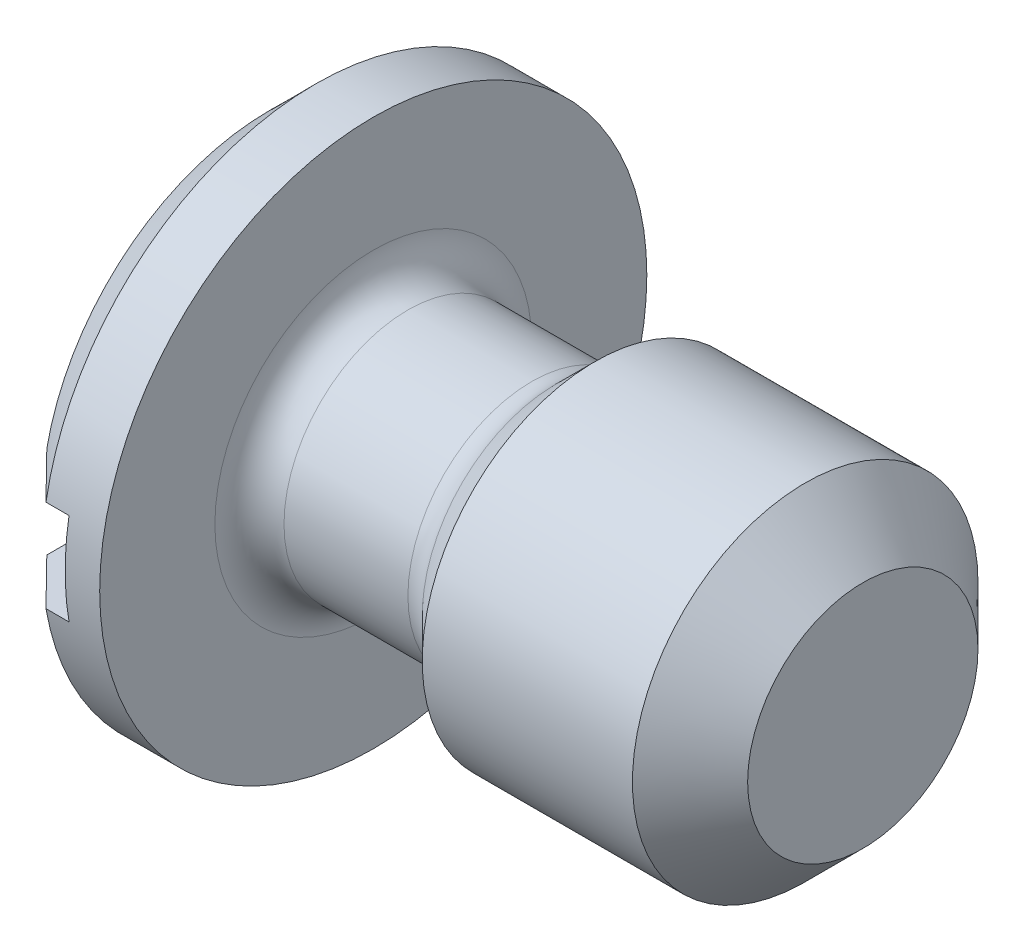
ISO-10303-21;
HEADER;
FILE_DESCRIPTION(('STEP AP214'),'2;1');
FILE_NAME('part.step','',(''),(''),'','','');
FILE_SCHEMA(('AUTOMOTIVE_DESIGN { 1 0 10303 214 1 1 1 1 }'));
ENDSEC;
DATA;
#1=APPLICATION_CONTEXT('core data for automotive mechanical design processes');
#2=APPLICATION_PROTOCOL_DEFINITION('international standard','automotive_design',2000,#1);
#3=PRODUCT_CONTEXT('',#1,'mechanical');
#4=PRODUCT('Part','Part','',(#3));
#5=PRODUCT_RELATED_PRODUCT_CATEGORY('part','',(#4));
#6=PRODUCT_DEFINITION_FORMATION('','',#4);
#7=PRODUCT_DEFINITION_CONTEXT('part definition',#1,'design');
#8=PRODUCT_DEFINITION('design','',#6,#7);
#9=PRODUCT_DEFINITION_SHAPE('','',#8);
#10=(LENGTH_UNIT() NAMED_UNIT(*) SI_UNIT(.MILLI.,.METRE.));
#11=(NAMED_UNIT(*) PLANE_ANGLE_UNIT() SI_UNIT($,.RADIAN.));
#12=(NAMED_UNIT(*) SI_UNIT($,.STERADIAN.) SOLID_ANGLE_UNIT());
#13=UNCERTAINTY_MEASURE_WITH_UNIT(LENGTH_MEASURE(1.E-05),#10,'distance_accuracy_value','');
#14=(GEOMETRIC_REPRESENTATION_CONTEXT(3) GLOBAL_UNCERTAINTY_ASSIGNED_CONTEXT((#13)) GLOBAL_UNIT_ASSIGNED_CONTEXT((#10,
#11,#12)) REPRESENTATION_CONTEXT('',''));
#15=CARTESIAN_POINT('',(0.,0.,0.));
#16=DIRECTION('',(0.,0.,1.));
#17=DIRECTION('',(1.,0.,0.));
#18=AXIS2_PLACEMENT_3D('',#15,#16,#17);
#19=CARTESIAN_POINT('',(0.,0.,0.));
#20=DIRECTION('',(-1.,0.,0.));
#21=DIRECTION('',(0.,0.,1.));
#22=AXIS2_PLACEMENT_3D('',#19,#20,#21);
#23=PLANE('',#22);
#24=DIRECTION('',(0.,0.,1.));
#25=VECTOR('',#24,1.);
#26=CARTESIAN_POINT('',(0.,0.8,-4.75));
#27=LINE('',#26,#25);
#28=CARTESIAN_POINT('',(0.,0.8,-3.86813908746828));
#29=VERTEX_POINT('',#28);
#30=CARTESIAN_POINT('',(0.,0.8,3.86813908746828));
#31=VERTEX_POINT('',#30);
#32=EDGE_CURVE('E117',#29,#31,#27,.T.);
#33=ORIENTED_EDGE('',*,*,#32,.T.);
#34=CARTESIAN_POINT('',(0.,0.,0.));
#35=DIRECTION('',(-1.,0.,0.));
#36=DIRECTION('',(0.,0.,1.));
#37=AXIS2_PLACEMENT_3D('',#34,#35,#36);
#38=CIRCLE('',#37,3.95);
#39=EDGE_CURVE('E149',#31,#29,#38,.T.);
#40=ORIENTED_EDGE('',*,*,#39,.T.);
#41=EDGE_LOOP('',(#33,#40));
#42=FACE_BOUND('',#41,.T.);
#43=ADVANCED_FACE('F40',(#42),#23,.T.);
#44=CARTESIAN_POINT('',(0.8,0.,0.));
#45=DIRECTION('',(1.,0.,0.));
#46=DIRECTION('',(0.,0.,-1.));
#47=AXIS2_PLACEMENT_3D('',#44,#45,#46);
#48=CONICAL_SURFACE('',#47,4.75,0.78539816339745);
#49=CARTESIAN_POINT('',(6.52037482250324,0.8,10.4397676661749));
#50=CARTESIAN_POINT('',(6.15136825669687,0.8,10.0696697473426));
#51=CARTESIAN_POINT('',(5.78241014831491,0.8,9.69952346474628));
#52=CARTESIAN_POINT('',(5.04464323489698,0.8,8.9590544131115));
#53=CARTESIAN_POINT('',(4.67583443599593,0.8,8.58873163796088));
#54=CARTESIAN_POINT('',(3.93810928725278,0.8,7.84751906862884));
#55=CARTESIAN_POINT('',(3.56919314723139,0.8,7.47662906556224));
#56=CARTESIAN_POINT('',(2.83173082479307,0.8,6.73450834340233));
#57=CARTESIAN_POINT('',(2.46318462934194,0.8,6.36327763726313));
#58=CARTESIAN_POINT('',(1.74325100900508,0.8,5.63696337378255));
#59=CARTESIAN_POINT('',(1.3918379935054,0.8,5.28190520434829));
#60=CARTESIAN_POINT('',(0.865420464706685,0.8,4.74858585108821));
#61=CARTESIAN_POINT('',(0.690055241219821,0.8,4.57068082309624));
#62=CARTESIAN_POINT('',(0.339670555708075,0.8,4.21453418897044));
#63=CARTESIAN_POINT('',(0.16465109006867,0.8,4.03629258639365));
#64=CARTESIAN_POINT('',(-0.184790699141785,0.8,3.67941864271953));
#65=CARTESIAN_POINT('',(-0.359213300817199,0.8,3.5007865742638));
#66=CARTESIAN_POINT('',(-0.707288210615291,0.8,3.14275928573425));
#67=CARTESIAN_POINT('',(-0.880940487191331,0.8,2.96336403498505));
#68=CARTESIAN_POINT('',(-1.22694040352693,0.8,2.60338041305388));
#69=CARTESIAN_POINT('',(-1.399288288717,0.8,2.42279227893252));
#70=CARTESIAN_POINT('',(-1.65599055321655,0.8,2.15020595847071));
#71=CARTESIAN_POINT('',(-1.74125198181154,0.8,2.05906281171337));
#72=CARTESIAN_POINT('',(-1.91088443095753,0.8,1.8759524430792));
#73=CARTESIAN_POINT('',(-1.99525547411149,0.8,1.78398524223159));
#74=CARTESIAN_POINT('',(-2.10219795114576,0.8,1.66568024882915));
#75=CARTESIAN_POINT('',(-2.12539752729086,0.8,1.63991013192268));
#76=CARTESIAN_POINT('',(-2.17167492306251,0.8,1.58826070125648));
#77=CARTESIAN_POINT('',(-2.19475274235834,0.8,1.56238138720049));
#78=CARTESIAN_POINT('',(-2.2637835250412,0.8,1.48455443515526));
#79=CARTESIAN_POINT('',(-2.30952945846703,0.8,1.43242259282911));
#80=CARTESIAN_POINT('',(-2.40061862703419,0.8,1.32713448939713));
#81=CARTESIAN_POINT('',(-2.44595642567611,0.8,1.27397351382131));
#82=CARTESIAN_POINT('',(-2.53558963894994,0.8,1.16679959610384));
#83=CARTESIAN_POINT('',(-2.5798853235865,0.8,1.11278688083714));
#84=CARTESIAN_POINT('',(-2.66736970465533,0.8,1.00311860543151));
#85=CARTESIAN_POINT('',(-2.7105459125674,0.8,0.947453031067626));
#86=CARTESIAN_POINT('',(-2.79463616316944,0.8,0.834442840462976));
#87=CARTESIAN_POINT('',(-2.83555094964704,0.8,0.777098785885162));
#88=CARTESIAN_POINT('',(-2.91357432652409,0.8,0.660351043711915));
#89=CARTESIAN_POINT('',(-2.95070425055618,0.8,0.600961752936514));
#90=CARTESIAN_POINT('',(-3.01900170913,0.8,0.478869287734702));
#91=CARTESIAN_POINT('',(-3.05018547382141,0.8,0.416175747963666));
#92=CARTESIAN_POINT('',(-3.08601919465241,0.8,0.327037575021416));
#93=CARTESIAN_POINT('',(-3.09508616933292,0.8,0.302377754446018));
#94=CARTESIAN_POINT('',(-3.11144074179073,0.8,0.252465559583472));
#95=CARTESIAN_POINT('',(-3.11872827073957,0.8,0.227213162417021));
#96=CARTESIAN_POINT('',(-3.13117638082221,0.8,0.1762898460565));
#97=CARTESIAN_POINT('',(-3.13634542071924,0.8,0.150621025288174));
#98=CARTESIAN_POINT('',(-3.14431196858385,0.8,0.0989195348364079));
#99=CARTESIAN_POINT('',(-3.14711018456196,0.8,0.0728869761400846));
#100=CARTESIAN_POINT('',(-3.15017068382647,0.8,0.0204331742036754));
#101=CARTESIAN_POINT('',(-3.15040985492109,0.8,-0.00598945662524659));
#102=CARTESIAN_POINT('',(-3.1482820128489,0.8,-0.0587232504841389));
#103=CARTESIAN_POINT('',(-3.14591494506253,0.8,-0.0850344111664024));
#104=CARTESIAN_POINT('',(-3.1350876641866,0.8,-0.16359036680876));
#105=CARTESIAN_POINT('',(-3.12289547459145,0.8,-0.215340396335476));
#106=CARTESIAN_POINT('',(-3.09477744159526,0.8,-0.304597895252544));
#107=CARTESIAN_POINT('',(-3.08037338050207,0.8,-0.342624929122446));
#108=CARTESIAN_POINT('',(-3.0483262575746,0.8,-0.417312547190411));
#109=CARTESIAN_POINT('',(-3.03068060803105,0.8,-0.453972011349437));
#110=CARTESIAN_POINT('',(-2.99295352988007,0.8,-0.526205975054306));
#111=CARTESIAN_POINT('',(-2.97286129096967,0.8,-0.561774721118624));
#112=CARTESIAN_POINT('',(-2.93095568519759,0.8,-0.631852807209097));
#113=CARTESIAN_POINT('',(-2.9091430608949,0.8,-0.666362595468666));
#114=CARTESIAN_POINT('',(-2.85983614958794,0.8,-0.741215312179307));
#115=CARTESIAN_POINT('',(-2.83206630389377,0.8,-0.781375557532131));
#116=CARTESIAN_POINT('',(-2.77520761229419,0.8,-0.860755038449574));
#117=CARTESIAN_POINT('',(-2.74611850981156,0.8,-0.899974088677097));
#118=CARTESIAN_POINT('',(-2.65737461075156,0.8,-1.01658766281846));
#119=CARTESIAN_POINT('',(-2.59628100882571,0.8,-1.09288351888052));
#120=CARTESIAN_POINT('',(-2.47173566200138,0.8,-1.24380847114586));
#121=CARTESIAN_POINT('',(-2.40827854718954,0.8,-1.31843306623008));
#122=CARTESIAN_POINT('',(-2.27996591489505,0.8,-1.46641408175587));
#123=CARTESIAN_POINT('',(-2.21511097646062,0.8,-1.53977100547237));
#124=CARTESIAN_POINT('',(-2.08432482767916,0.8,-1.68576189850838));
#125=CARTESIAN_POINT('',(-2.01839183774892,0.8,-1.75839426685408));
#126=CARTESIAN_POINT('',(-1.88584277398022,0.8,-1.90304548250628));
#127=CARTESIAN_POINT('',(-1.81922663206099,0.8,-1.97506426732957));
#128=CARTESIAN_POINT('',(-1.68560264852239,0.8,-2.11853142067879));
#129=CARTESIAN_POINT('',(-1.6185955612509,0.8,-2.18998049282695));
#130=CARTESIAN_POINT('',(-1.48421175068479,0.8,-2.33252519393263));
#131=CARTESIAN_POINT('',(-1.41683504022177,0.8,-2.40362083499833));
#132=CARTESIAN_POINT('',(-1.21551266940261,0.8,-2.61520735140471));
#133=CARTESIAN_POINT('',(-1.08115219320841,0.8,-2.7553033632997));
#134=CARTESIAN_POINT('',(-0.811727281867521,0.8,-3.03481727455736));
#135=CARTESIAN_POINT('',(-0.676662841614753,0.8,-3.17423516898722));
#136=CARTESIAN_POINT('',(-0.270761112260845,0.8,-3.591816424846));
#137=CARTESIAN_POINT('',(0.000776363490592952,0.8,-3.86929878599305));
#138=CARTESIAN_POINT('',(0.544963853096162,0.8,-4.42350096415641));
#139=CARTESIAN_POINT('',(0.817614445111972,0.8,-4.70022021199056));
#140=CARTESIAN_POINT('',(1.36347962067764,0.8,-5.25309368659273));
#141=CARTESIAN_POINT('',(1.63669419572849,0.8,-5.5292479217522));
#142=CARTESIAN_POINT('',(2.18285555483684,0.8,-6.08056889061803));
#143=CARTESIAN_POINT('',(2.45580151871183,0.8,-6.35573643733633));
#144=CARTESIAN_POINT('',(3.00193727990195,0.8,-6.9058315624128));
#145=CARTESIAN_POINT('',(3.27512707816782,0.8,-7.18075913982698));
#146=CARTESIAN_POINT('',(4.09486435888319,0.8,-8.00520604584285));
#147=CARTESIAN_POINT('',(4.64166405887839,0.8,-8.55447457225095));
#148=CARTESIAN_POINT('',(5.29955834634896,0.8,-9.2149019148827));
#149=CARTESIAN_POINT('',(5.41047871294538,0.8,-9.32623440575771));
#150=CARTESIAN_POINT('',(5.63233611435641,0.8,-9.54888767547784));
#151=CARTESIAN_POINT('',(5.74327314948474,0.8,-9.66020845401042));
#152=CARTESIAN_POINT('',(5.96523224273613,0.8,-9.88291012338486));
#153=CARTESIAN_POINT('',(6.0762543090855,0.8,-9.99429100602731));
#154=CARTESIAN_POINT('',(6.2983074672399,0.8,-10.2170388666468));
#155=CARTESIAN_POINT('',(6.40933855879125,0.8,-10.3284058448766));
#156=CARTESIAN_POINT('',(6.52037482250324,0.8,-10.4397676661749));
#157=B_SPLINE_CURVE_WITH_KNOTS('',3,(#49,#50,#51,#52,#53,#54,#55,#56,#57,#58,#59,#60,#61,#62,
#63,#64,#65,#66,#67,#68,#69,#70,#71,#72,#73,#74,#75,#76,#77,#78,#79,#80,#81,#82,#83,#84,#85,#86,
#87,#88,#89,#90,#91,#92,#93,#94,#95,#96,#97,#98,#99,#100,#101,#102,#103,#104,#105,#106,#107,
#108,#109,#110,#111,#112,#113,#114,#115,#116,#117,#118,#119,#120,#121,#122,#123,#124,#125,#126,
#127,#128,#129,#130,#131,#132,#133,#134,#135,#136,#137,#138,#139,#140,#141,#142,#143,#144,#145,
#146,#147,#148,#149,#150,#151,#152,#153,#154,#155,#156),.UNSPECIFIED.,.F.,.F.,(4,2,2,2,2,2,2,2,
2,2,2,2,2,2,2,2,2,2,2,2,2,2,2,2,2,2,2,2,2,2,2,2,2,2,2,2,2,2,2,2,2,2,2,2,2,2,2,2,2,2,2,2,2,4),
(0.,1.56787913460948,3.13581721705964,4.70518845267162,6.27450230449675,7.77317273152935,
8.52259113234136,9.27200165689733,10.0209951401311,10.7700190183781,11.5188982720843,
11.8933136432876,12.2677194867663,12.3717425768971,12.475765949434,12.6838321490987,
12.8934286718658,13.1029702778341,13.3142793074763,13.525518418298,13.7354920447365,
13.9448840724976,14.02365153302,14.1024220397639,14.1808748911441,14.2593043055063,
14.3384414690031,14.4175802910278,14.5762040863143,14.6980382730303,14.8199701440712,
14.9424617809295,15.0649008338342,15.2113419273116,15.3578116247279,15.6509511674867,
15.9448030930274,16.2385355451149,16.5328150747681,16.8271242220311,17.120983518368,
17.4148326770312,17.9971653390258,18.5795022307643,19.7442116482766,20.9096323624513,
22.0750356405434,23.2377693640086,24.4005076410267,26.7256249347531,27.1970952565875,
27.6685759785828,28.1403644921523,28.6121425793144),.UNSPECIFIED.);
#158=CARTESIAN_POINT('',(0.8,0.8,4.68214694344379));
#159=VERTEX_POINT('',#158);
#160=EDGE_CURVE('E223',#159,#31,#157,.T.);
#161=ORIENTED_EDGE('',*,*,#160,.F.);
#162=CARTESIAN_POINT('',(0.8,0.,0.));
#163=DIRECTION('',(-1.,0.,0.));
#164=DIRECTION('',(0.,0.,1.));
#165=AXIS2_PLACEMENT_3D('',#162,#163,#164);
#166=CIRCLE('',#165,4.75);
#167=CARTESIAN_POINT('',(0.800000000000007,0.8,-4.6821469434438));
#168=VERTEX_POINT('',#167);
#169=EDGE_CURVE('E146',#168,#159,#166,.F.);
#170=ORIENTED_EDGE('',*,*,#169,.F.);
#171=EDGE_CURVE('E159',#29,#168,#157,.T.);
#172=ORIENTED_EDGE('',*,*,#171,.F.);
#173=ORIENTED_EDGE('',*,*,#39,.F.);
#174=EDGE_LOOP('',(#161,#170,#172,#173));
#175=FACE_BOUND('',#174,.T.);
#176=ADVANCED_FACE('F194',(#175),#48,.T.);
#177=DIRECTION('',(0.,0.,1.));
#178=VECTOR('',#177,1.);
#179=CARTESIAN_POINT('',(0.,-0.8,-4.75));
#180=LINE('',#179,#178);
#181=CARTESIAN_POINT('',(0.,-0.8,-3.86813908746828));
#182=VERTEX_POINT('',#181);
#183=CARTESIAN_POINT('',(0.,-0.8,3.86813908746828));
#184=VERTEX_POINT('',#183);
#185=EDGE_CURVE('E56',#182,#184,#180,.T.);
#186=ORIENTED_EDGE('',*,*,#185,.F.);
#187=EDGE_CURVE('E153',#182,#184,#38,.T.);
#188=ORIENTED_EDGE('',*,*,#187,.T.);
#189=EDGE_LOOP('',(#186,#188));
#190=FACE_BOUND('',#189,.T.);
#191=ADVANCED_FACE('F191',(#190),#23,.T.);
#192=CARTESIAN_POINT('',(0.,0.,0.));
#193=DIRECTION('',(1.,0.,0.));
#194=DIRECTION('',(0.,0.,-1.));
#195=AXIS2_PLACEMENT_3D('',#192,#193,#194);
#196=CYLINDRICAL_SURFACE('',#195,4.75);
#197=DIRECTION('',(1.,0.,0.));
#198=VECTOR('',#197,1.);
#199=CARTESIAN_POINT('',(0.,-0.8,-4.68214694344379));
#200=LINE('',#199,#198);
#201=CARTESIAN_POINT('',(1.2,-0.8,-4.68214694344379));
#202=VERTEX_POINT('',#201);
#203=CARTESIAN_POINT('',(0.8,-0.8,-4.68214694344379));
#204=VERTEX_POINT('',#203);
#205=EDGE_CURVE('E104',#202,#204,#200,.F.);
#206=ORIENTED_EDGE('',*,*,#205,.F.);
#207=CARTESIAN_POINT('',(1.2,0.,0.));
#208=DIRECTION('',(1.,0.,0.));
#209=DIRECTION('',(0.,0.,-1.));
#210=AXIS2_PLACEMENT_3D('',#207,#208,#209);
#211=CIRCLE('',#210,4.75);
#212=CARTESIAN_POINT('',(1.2,0.8,-4.68214694344379));
#213=VERTEX_POINT('',#212);
#214=EDGE_CURVE('E11',#213,#202,#211,.F.);
#215=ORIENTED_EDGE('',*,*,#214,.F.);
#216=DIRECTION('',(1.,0.,0.));
#217=VECTOR('',#216,1.);
#218=CARTESIAN_POINT('',(0.,0.8,-4.68214694344379));
#219=LINE('',#218,#217);
#220=EDGE_CURVE('E114',#168,#213,#219,.T.);
#221=ORIENTED_EDGE('',*,*,#220,.F.);
#222=ORIENTED_EDGE('',*,*,#169,.T.);
#223=DIRECTION('',(1.,0.,0.));
#224=VECTOR('',#223,1.);
#225=CARTESIAN_POINT('',(0.,0.8,4.68214694344379));
#226=LINE('',#225,#224);
#227=CARTESIAN_POINT('',(1.2,0.8,4.68214694344379));
#228=VERTEX_POINT('',#227);
#229=EDGE_CURVE('E64',#228,#159,#226,.F.);
#230=ORIENTED_EDGE('',*,*,#229,.F.);
#231=CARTESIAN_POINT('',(1.2,-0.8,4.68214694344379));
#232=VERTEX_POINT('',#231);
#233=EDGE_CURVE('E45',#232,#228,#211,.F.);
#234=ORIENTED_EDGE('',*,*,#233,.F.);
#235=DIRECTION('',(1.,0.,0.));
#236=VECTOR('',#235,1.);
#237=CARTESIAN_POINT('',(0.,-0.8,4.68214694344379));
#238=LINE('',#237,#236);
#239=CARTESIAN_POINT('',(0.800000000000007,-0.8,4.6821469434438));
#240=VERTEX_POINT('',#239);
#241=EDGE_CURVE('E107',#240,#232,#238,.T.);
#242=ORIENTED_EDGE('',*,*,#241,.F.);
#243=EDGE_CURVE('E113',#240,#204,#166,.F.);
#244=ORIENTED_EDGE('',*,*,#243,.T.);
#245=EDGE_LOOP('',(#206,#215,#221,#222,#230,#234,#242,#244));
#246=FACE_BOUND('',#245,.T.);
#247=CARTESIAN_POINT('',(1.8,0.,0.));
#248=DIRECTION('',(1.,0.,0.));
#249=DIRECTION('',(0.,0.,-1.));
#250=AXIS2_PLACEMENT_3D('',#247,#248,#249);
#251=CIRCLE('',#250,4.75);
#252=CARTESIAN_POINT('',(1.8,0.,-4.75));
#253=VERTEX_POINT('',#252);
#254=EDGE_CURVE('E125',#253,#253,#251,.T.);
#255=ORIENTED_EDGE('',*,*,#254,.F.);
#256=EDGE_LOOP('',(#255));
#257=FACE_BOUND('',#256,.T.);
#258=ADVANCED_FACE('F110',(#246,#257),#196,.T.);
#259=CARTESIAN_POINT('',(1.8,4.75,0.));
#260=DIRECTION('',(1.,0.,0.));
#261=DIRECTION('',(0.,0.,-1.));
#262=AXIS2_PLACEMENT_3D('',#259,#260,#261);
#263=PLANE('',#262);
#264=CARTESIAN_POINT('',(1.8,0.,0.));
#265=DIRECTION('',(1.,0.,0.));
#266=DIRECTION('',(0.,0.,-1.));
#267=AXIS2_PLACEMENT_3D('',#264,#265,#266);
#268=CIRCLE('',#267,2.75);
#269=CARTESIAN_POINT('',(1.8,0.,-2.75));
#270=VERTEX_POINT('',#269);
#271=EDGE_CURVE('E143',#270,#270,#268,.F.);
#272=ORIENTED_EDGE('',*,*,#271,.T.);
#273=EDGE_LOOP('',(#272));
#274=FACE_BOUND('',#273,.T.);
#275=ORIENTED_EDGE('',*,*,#254,.T.);
#276=EDGE_LOOP('',(#275));
#277=FACE_BOUND('',#276,.T.);
#278=ADVANCED_FACE('F184',(#274,#277),#263,.T.);
#279=CARTESIAN_POINT('',(0.,0.,0.));
#280=DIRECTION('',(1.,0.,0.));
#281=DIRECTION('',(0.,0.,-1.));
#282=AXIS2_PLACEMENT_3D('',#279,#280,#281);
#283=CYLINDRICAL_SURFACE('',#282,2.15);
#284=CARTESIAN_POINT('',(4.55147186257614,0.,0.));
#285=DIRECTION('',(1.,0.,0.));
#286=DIRECTION('',(0.,0.,-1.));
#287=AXIS2_PLACEMENT_3D('',#284,#285,#286);
#288=CIRCLE('',#287,2.15);
#289=CARTESIAN_POINT('',(4.55147186257614,0.,-2.15));
#290=VERTEX_POINT('',#289);
#291=EDGE_CURVE('E140',#290,#290,#288,.F.);
#292=ORIENTED_EDGE('',*,*,#291,.T.);
#293=EDGE_LOOP('',(#292));
#294=FACE_BOUND('',#293,.T.);
#295=CARTESIAN_POINT('',(2.4,0.,0.));
#296=DIRECTION('',(1.,0.,0.));
#297=DIRECTION('',(0.,0.,-1.));
#298=AXIS2_PLACEMENT_3D('',#295,#296,#297);
#299=CIRCLE('',#298,2.15);
#300=CARTESIAN_POINT('',(2.4,0.,-2.15));
#301=VERTEX_POINT('',#300);
#302=EDGE_CURVE('E137',#301,#301,#299,.T.);
#303=ORIENTED_EDGE('',*,*,#302,.T.);
#304=EDGE_LOOP('',(#303));
#305=FACE_BOUND('',#304,.T.);
#306=ADVANCED_FACE('F180',(#294,#305),#283,.T.);
#307=CARTESIAN_POINT('',(5.65,0.,0.));
#308=DIRECTION('',(1.,0.,0.));
#309=DIRECTION('',(0.,0.,-1.));
#310=AXIS2_PLACEMENT_3D('',#307,#308,#309);
#311=CONICAL_SURFACE('',#310,3.,0.785398163397451);
#312=CARTESIAN_POINT('',(4.97573593128807,0.,0.));
#313=DIRECTION('',(1.,0.,0.));
#314=DIRECTION('',(0.,0.,-1.));
#315=AXIS2_PLACEMENT_3D('',#312,#313,#314);
#316=CIRCLE('',#315,2.32573593128807);
#317=CARTESIAN_POINT('',(4.97573593128807,0.,-2.32573593128807));
#318=VERTEX_POINT('',#317);
#319=EDGE_CURVE('E134',#318,#318,#316,.T.);
#320=ORIENTED_EDGE('',*,*,#319,.T.);
#321=EDGE_LOOP('',(#320));
#322=FACE_BOUND('',#321,.T.);
#323=CARTESIAN_POINT('',(5.65,0.,0.));
#324=DIRECTION('',(1.,0.,0.));
#325=DIRECTION('',(0.,0.,-1.));
#326=AXIS2_PLACEMENT_3D('',#323,#324,#325);
#327=CIRCLE('',#326,3.);
#328=CARTESIAN_POINT('',(5.65,0.,-3.));
#329=VERTEX_POINT('',#328);
#330=EDGE_CURVE('E122',#329,#329,#327,.T.);
#331=ORIENTED_EDGE('',*,*,#330,.F.);
#332=EDGE_LOOP('',(#331));
#333=FACE_BOUND('',#332,.T.);
#334=ADVANCED_FACE('F176',(#322,#333),#311,.T.);
#335=CARTESIAN_POINT('',(0.,0.,0.));
#336=DIRECTION('',(1.,0.,0.));
#337=DIRECTION('',(0.,0.,-1.));
#338=AXIS2_PLACEMENT_3D('',#335,#336,#337);
#339=CYLINDRICAL_SURFACE('',#338,3.);
#340=CARTESIAN_POINT('',(9.3,0.,0.));
#341=DIRECTION('',(1.,0.,0.));
#342=DIRECTION('',(0.,0.,-1.));
#343=AXIS2_PLACEMENT_3D('',#340,#341,#342);
#344=CIRCLE('',#343,3.);
#345=CARTESIAN_POINT('',(9.3,0.,-3.));
#346=VERTEX_POINT('',#345);
#347=EDGE_CURVE('E131',#346,#346,#344,.F.);
#348=ORIENTED_EDGE('',*,*,#347,.T.);
#349=EDGE_LOOP('',(#348));
#350=FACE_BOUND('',#349,.T.);
#351=ORIENTED_EDGE('',*,*,#330,.T.);
#352=EDGE_LOOP('',(#351));
#353=FACE_BOUND('',#352,.T.);
#354=ADVANCED_FACE('F172',(#350,#353),#339,.T.);
#355=CARTESIAN_POINT('',(10.3,3.,0.));
#356=DIRECTION('',(1.,0.,0.));
#357=DIRECTION('',(0.,0.,-1.));
#358=AXIS2_PLACEMENT_3D('',#355,#356,#357);
#359=PLANE('',#358);
#360=CARTESIAN_POINT('',(10.3,0.,0.));
#361=DIRECTION('',(1.,0.,0.));
#362=DIRECTION('',(0.,0.,-1.));
#363=AXIS2_PLACEMENT_3D('',#360,#361,#362);
#364=CIRCLE('',#363,2.);
#365=CARTESIAN_POINT('',(10.3,0.,-2.));
#366=VERTEX_POINT('',#365);
#367=EDGE_CURVE('E128',#366,#366,#364,.T.);
#368=ORIENTED_EDGE('',*,*,#367,.T.);
#369=EDGE_LOOP('',(#368));
#370=FACE_BOUND('',#369,.T.);
#371=ADVANCED_FACE('F168',(#370),#359,.T.);
#372=CARTESIAN_POINT('',(10.3,0.,0.));
#373=DIRECTION('',(-1.,0.,0.));
#374=DIRECTION('',(0.,0.,1.));
#375=AXIS2_PLACEMENT_3D('',#372,#373,#374);
#376=CONICAL_SURFACE('',#375,2.,0.785398163397447);
#377=ORIENTED_EDGE('',*,*,#347,.F.);
#378=EDGE_LOOP('',(#377));
#379=FACE_BOUND('',#378,.T.);
#380=ORIENTED_EDGE('',*,*,#367,.F.);
#381=EDGE_LOOP('',(#380));
#382=FACE_BOUND('',#381,.T.);
#383=ADVANCED_FACE('F171',(#379,#382),#376,.T.);
#384=CARTESIAN_POINT('',(4.55147186257614,0.,0.));
#385=DIRECTION('',(1.,0.,0.));
#386=DIRECTION('',(0.,0.,-1.));
#387=AXIS2_PLACEMENT_3D('',#384,#385,#386);
#388=TOROIDAL_SURFACE('',#387,2.75,0.6);
#389=ORIENTED_EDGE('',*,*,#291,.F.);
#390=EDGE_LOOP('',(#389));
#391=FACE_BOUND('',#390,.T.);
#392=ORIENTED_EDGE('',*,*,#319,.F.);
#393=EDGE_LOOP('',(#392));
#394=FACE_BOUND('',#393,.T.);
#395=ADVANCED_FACE('F198',(#391,#394),#388,.F.);
#396=CARTESIAN_POINT('',(2.4,0.,0.));
#397=DIRECTION('',(1.,0.,0.));
#398=DIRECTION('',(0.,0.,-1.));
#399=AXIS2_PLACEMENT_3D('',#396,#397,#398);
#400=TOROIDAL_SURFACE('',#399,2.75,0.6);
#401=ORIENTED_EDGE('',*,*,#271,.F.);
#402=EDGE_LOOP('',(#401));
#403=FACE_BOUND('',#402,.T.);
#404=ORIENTED_EDGE('',*,*,#302,.F.);
#405=EDGE_LOOP('',(#404));
#406=FACE_BOUND('',#405,.T.);
#407=ADVANCED_FACE('F201',(#403,#406),#400,.F.);
#408=CARTESIAN_POINT('',(6.52037482250324,-0.8,-10.4397676661749));
#409=CARTESIAN_POINT('',(6.15136825669687,-0.8,-10.0696697473426));
#410=CARTESIAN_POINT('',(5.78241014831491,-0.8,-9.69952346474628));
#411=CARTESIAN_POINT('',(5.04464323489698,-0.8,-8.9590544131115));
#412=CARTESIAN_POINT('',(4.67583443599593,-0.8,-8.58873163796088));
#413=CARTESIAN_POINT('',(3.93810928725278,-0.8,-7.84751906862884));
#414=CARTESIAN_POINT('',(3.56919314723139,-0.8,-7.47662906556224));
#415=CARTESIAN_POINT('',(2.83173082479307,-0.8,-6.73450834340233));
#416=CARTESIAN_POINT('',(2.46318462934194,-0.8,-6.36327763726313));
#417=CARTESIAN_POINT('',(1.74325100900508,-0.8,-5.63696337378255));
#418=CARTESIAN_POINT('',(1.3918379935054,-0.8,-5.28190520434829));
#419=CARTESIAN_POINT('',(0.865420464706684,-0.8,-4.74858585108821));
#420=CARTESIAN_POINT('',(0.69005524121982,-0.8,-4.57068082309623));
#421=CARTESIAN_POINT('',(0.339670555708073,-0.8,-4.21453418897044));
#422=CARTESIAN_POINT('',(0.164651090068668,-0.8,-4.03629258639365));
#423=CARTESIAN_POINT('',(-0.184790699141787,-0.8,-3.67941864271953));
#424=CARTESIAN_POINT('',(-0.3592133008172,-0.8,-3.5007865742638));
#425=CARTESIAN_POINT('',(-0.707288210615292,-0.8,-3.14275928573425));
#426=CARTESIAN_POINT('',(-0.880940487191332,-0.8,-2.96336403498505));
#427=CARTESIAN_POINT('',(-1.22694040352693,-0.8,-2.60338041305388));
#428=CARTESIAN_POINT('',(-1.399288288717,-0.8,-2.42279227893252));
#429=CARTESIAN_POINT('',(-1.65599055321655,-0.8,-2.15020595847071));
#430=CARTESIAN_POINT('',(-1.74125198181154,-0.8,-2.05906281171337));
#431=CARTESIAN_POINT('',(-1.91088443095753,-0.8,-1.8759524430792));
#432=CARTESIAN_POINT('',(-1.99525547411149,-0.8,-1.78398524223158));
#433=CARTESIAN_POINT('',(-2.10219795114576,-0.8,-1.66568024882915));
#434=CARTESIAN_POINT('',(-2.12539752729086,-0.8,-1.63991013192268));
#435=CARTESIAN_POINT('',(-2.17167492306251,-0.8,-1.58826070125648));
#436=CARTESIAN_POINT('',(-2.19475274235835,-0.8,-1.56238138720049));
#437=CARTESIAN_POINT('',(-2.2637835250412,-0.8,-1.48455443515525));
#438=CARTESIAN_POINT('',(-2.30952945846703,-0.8,-1.43242259282911));
#439=CARTESIAN_POINT('',(-2.40061862703419,-0.8,-1.32713448939713));
#440=CARTESIAN_POINT('',(-2.44595642567611,-0.8,-1.27397351382131));
#441=CARTESIAN_POINT('',(-2.53558963894994,-0.8,-1.16679959610384));
#442=CARTESIAN_POINT('',(-2.5798853235865,-0.8,-1.11278688083714));
#443=CARTESIAN_POINT('',(-2.66736970465533,-0.8,-1.00311860543151));
#444=CARTESIAN_POINT('',(-2.7105459125674,-0.8,-0.947453031067625));
#445=CARTESIAN_POINT('',(-2.79463616316944,-0.8,-0.834442840462976));
#446=CARTESIAN_POINT('',(-2.83555094964704,-0.8,-0.777098785885161));
#447=CARTESIAN_POINT('',(-2.91357432652409,-0.8,-0.660351043711915));
#448=CARTESIAN_POINT('',(-2.95070425055618,-0.8,-0.600961752936513));
#449=CARTESIAN_POINT('',(-3.01900170913,-0.8,-0.478869287734701));
#450=CARTESIAN_POINT('',(-3.05018547382141,-0.8,-0.416175747963665));
#451=CARTESIAN_POINT('',(-3.08601919465241,-0.8,-0.327037575021415));
#452=CARTESIAN_POINT('',(-3.09508616933292,-0.8,-0.302377754446017));
#453=CARTESIAN_POINT('',(-3.11144074179073,-0.8,-0.252465559583472));
#454=CARTESIAN_POINT('',(-3.11872827073957,-0.8,-0.22721316241702));
#455=CARTESIAN_POINT('',(-3.13117638082221,-0.8,-0.1762898460565));
#456=CARTESIAN_POINT('',(-3.13634542071924,-0.8,-0.150621025288174));
#457=CARTESIAN_POINT('',(-3.14431196858385,-0.8,-0.0989195348364073));
#458=CARTESIAN_POINT('',(-3.14711018456196,-0.8,-0.0728869761400839));
#459=CARTESIAN_POINT('',(-3.15017068382647,-0.8,-0.0204331742036747));
#460=CARTESIAN_POINT('',(-3.15040985492109,-0.8,0.00598945662524726));
#461=CARTESIAN_POINT('',(-3.1482820128489,-0.8,0.0587232504841396));
#462=CARTESIAN_POINT('',(-3.14591494506253,-0.8,0.0850344111664031));
#463=CARTESIAN_POINT('',(-3.1350876641866,-0.8,0.163590366808761));
#464=CARTESIAN_POINT('',(-3.12289547459145,-0.8,0.215340396335476));
#465=CARTESIAN_POINT('',(-3.09477744159525,-0.8,0.304597895252545));
#466=CARTESIAN_POINT('',(-3.08037338050207,-0.8,0.342624929122447));
#467=CARTESIAN_POINT('',(-3.0483262575746,-0.8,0.417312547190411));
#468=CARTESIAN_POINT('',(-3.03068060803105,-0.8,0.453972011349438));
#469=CARTESIAN_POINT('',(-2.99295352988007,-0.8,0.526205975054306));
#470=CARTESIAN_POINT('',(-2.97286129096967,-0.8,0.561774721118625));
#471=CARTESIAN_POINT('',(-2.93095568519759,-0.8,0.631852807209098));
#472=CARTESIAN_POINT('',(-2.9091430608949,-0.8,0.666362595468668));
#473=CARTESIAN_POINT('',(-2.85983614958794,-0.8,0.741215312179308));
#474=CARTESIAN_POINT('',(-2.83206630389377,-0.8,0.781375557532132));
#475=CARTESIAN_POINT('',(-2.77520761229419,-0.8,0.860755038449575));
#476=CARTESIAN_POINT('',(-2.74611850981156,-0.8,0.899974088677098));
#477=CARTESIAN_POINT('',(-2.65737461075156,-0.8,1.01658766281846));
#478=CARTESIAN_POINT('',(-2.59628100882571,-0.8,1.09288351888052));
#479=CARTESIAN_POINT('',(-2.47173566200137,-0.8,1.24380847114587));
#480=CARTESIAN_POINT('',(-2.40827854718954,-0.8,1.31843306623008));
#481=CARTESIAN_POINT('',(-2.27996591489504,-0.8,1.46641408175588));
#482=CARTESIAN_POINT('',(-2.21511097646061,-0.8,1.53977100547237));
#483=CARTESIAN_POINT('',(-2.08432482767916,-0.8,1.68576189850838));
#484=CARTESIAN_POINT('',(-2.01839183774892,-0.8,1.75839426685408));
#485=CARTESIAN_POINT('',(-1.88584277398021,-0.8,1.90304548250629));
#486=CARTESIAN_POINT('',(-1.81922663206098,-0.8,1.97506426732958));
#487=CARTESIAN_POINT('',(-1.68560264852238,-0.8,2.1185314206788));
#488=CARTESIAN_POINT('',(-1.61859556125089,-0.8,2.18998049282696));
#489=CARTESIAN_POINT('',(-1.48421175068478,-0.8,2.33252519393263));
#490=CARTESIAN_POINT('',(-1.41683504022177,-0.8,2.40362083499834));
#491=CARTESIAN_POINT('',(-1.2155126694026,-0.8,2.61520735140471));
#492=CARTESIAN_POINT('',(-1.0811521932084,-0.8,2.7553033632997));
#493=CARTESIAN_POINT('',(-0.811727281867513,-0.8,3.03481727455737));
#494=CARTESIAN_POINT('',(-0.676662841614745,-0.8,3.17423516898723));
#495=CARTESIAN_POINT('',(-0.270761112260836,-0.8,3.59181642484601));
#496=CARTESIAN_POINT('',(0.000776363490603415,-0.8,3.86929878599306));
#497=CARTESIAN_POINT('',(0.544963853096173,-0.8,4.42350096415642));
#498=CARTESIAN_POINT('',(0.817614445111983,-0.8,4.70022021199057));
#499=CARTESIAN_POINT('',(1.36347962067765,-0.8,5.25309368659274));
#500=CARTESIAN_POINT('',(1.6366941957285,-0.8,5.52924792175221));
#501=CARTESIAN_POINT('',(2.18285555483686,-0.8,6.08056889061805));
#502=CARTESIAN_POINT('',(2.45580151871185,-0.8,6.35573643733635));
#503=CARTESIAN_POINT('',(3.00193727990197,-0.8,6.90583156241282));
#504=CARTESIAN_POINT('',(3.27512707816783,-0.8,7.180759139827));
#505=CARTESIAN_POINT('',(4.0948643588832,-0.8,8.00520604584287));
#506=CARTESIAN_POINT('',(4.64166405887841,-0.8,8.55447457225097));
#507=CARTESIAN_POINT('',(5.29955834634898,-0.8,9.21490191488272));
#508=CARTESIAN_POINT('',(5.41047871294539,-0.8,9.32623440575773));
#509=CARTESIAN_POINT('',(5.63233611435642,-0.8,9.54888767547785));
#510=CARTESIAN_POINT('',(5.74327314948475,-0.8,9.66020845401043));
#511=CARTESIAN_POINT('',(5.96523224273614,-0.8,9.88291012338487));
#512=CARTESIAN_POINT('',(6.07625430908551,-0.8,9.99429100602732));
#513=CARTESIAN_POINT('',(6.2983074672399,-0.8,10.2170388666468));
#514=CARTESIAN_POINT('',(6.40933855879125,-0.8,10.3284058448766));
#515=CARTESIAN_POINT('',(6.52037482250324,-0.8,10.4397676661749));
#516=B_SPLINE_CURVE_WITH_KNOTS('',3,(#408,#409,#410,#411,#412,#413,#414,#415,#416,#417,#418,
#419,#420,#421,#422,#423,#424,#425,#426,#427,#428,#429,#430,#431,#432,#433,#434,#435,#436,#437,
#438,#439,#440,#441,#442,#443,#444,#445,#446,#447,#448,#449,#450,#451,#452,#453,#454,#455,#456,
#457,#458,#459,#460,#461,#462,#463,#464,#465,#466,#467,#468,#469,#470,#471,#472,#473,#474,#475,
#476,#477,#478,#479,#480,#481,#482,#483,#484,#485,#486,#487,#488,#489,#490,#491,#492,#493,#494,
#495,#496,#497,#498,#499,#500,#501,#502,#503,#504,#505,#506,#507,#508,#509,#510,#511,#512,#513,
#514,#515),.UNSPECIFIED.,.F.,.F.,(4,2,2,2,2,2,2,2,2,2,2,2,2,2,2,2,2,2,2,2,2,2,2,2,2,2,2,2,2,2,2,
2,2,2,2,2,2,2,2,2,2,2,2,2,2,2,2,2,2,2,2,2,2,4),(0.,1.56787913460948,3.13581721705964,
4.70518845267161,6.27450230449675,7.77317273152935,8.52259113234136,9.27200165689733,
10.0209951401311,10.7700190183781,11.5188982720843,11.8933136432876,12.2677194867663,
12.3717425768971,12.475765949434,12.6838321490987,12.8934286718658,13.1029702778341,
13.3142793074763,13.525518418298,13.7354920447365,13.9448840724976,14.02365153302,
14.1024220397639,14.1808748911441,14.2593043055063,14.3384414690031,14.4175802910278,
14.5762040863143,14.6980382730303,14.8199701440712,14.9424617809295,15.0649008338342,
15.2113419273116,15.3578116247279,15.6509511674867,15.9448030930274,16.2385355451149,
16.5328150747681,16.8271242220311,17.120983518368,17.4148326770312,17.9971653390258,
18.5795022307643,19.7442116482766,20.9096323624513,22.0750356405434,23.2377693640087,
24.4005076410267,26.7256249347532,27.1970952565875,27.6685759785828,28.1403644921523,
28.6121425793144),.UNSPECIFIED.);
#517=EDGE_CURVE('E158',#204,#182,#516,.T.);
#518=ORIENTED_EDGE('',*,*,#517,.F.);
#519=ORIENTED_EDGE('',*,*,#243,.F.);
#520=EDGE_CURVE('E152',#184,#240,#516,.T.);
#521=ORIENTED_EDGE('',*,*,#520,.F.);
#522=ORIENTED_EDGE('',*,*,#187,.F.);
#523=EDGE_LOOP('',(#518,#519,#521,#522));
#524=FACE_BOUND('',#523,.T.);
#525=ADVANCED_FACE('F42',(#524),#48,.T.);
#526=CARTESIAN_POINT('',(0.,0.8,-4.75));
#527=DIRECTION('',(0.,1.,0.));
#528=DIRECTION('',(0.,0.,1.));
#529=AXIS2_PLACEMENT_3D('',#526,#527,#528);
#530=PLANE('',#529);
#531=ORIENTED_EDGE('',*,*,#229,.T.);
#532=ORIENTED_EDGE('',*,*,#160,.T.);
#533=ORIENTED_EDGE('',*,*,#32,.F.);
#534=ORIENTED_EDGE('',*,*,#171,.T.);
#535=ORIENTED_EDGE('',*,*,#220,.T.);
#536=DIRECTION('',(0.,0.,1.));
#537=VECTOR('',#536,1.);
#538=CARTESIAN_POINT('',(1.2,0.8,-4.75));
#539=LINE('',#538,#537);
#540=EDGE_CURVE('E98',#213,#228,#539,.T.);
#541=ORIENTED_EDGE('',*,*,#540,.T.);
#542=EDGE_LOOP('',(#531,#532,#533,#534,#535,#541));
#543=FACE_BOUND('',#542,.T.);
#544=ADVANCED_FACE('F208',(#543),#530,.F.);
#545=CARTESIAN_POINT('',(1.2,0.8,-4.75));
#546=DIRECTION('',(1.,0.,0.));
#547=DIRECTION('',(0.,0.,-1.));
#548=AXIS2_PLACEMENT_3D('',#545,#546,#547);
#549=PLANE('',#548);
#550=DIRECTION('',(0.,0.,1.));
#551=VECTOR('',#550,1.);
#552=CARTESIAN_POINT('',(1.2,-0.8,-4.75));
#553=LINE('',#552,#551);
#554=EDGE_CURVE('E97',#202,#232,#553,.T.);
#555=ORIENTED_EDGE('',*,*,#554,.T.);
#556=ORIENTED_EDGE('',*,*,#233,.T.);
#557=ORIENTED_EDGE('',*,*,#540,.F.);
#558=ORIENTED_EDGE('',*,*,#214,.T.);
#559=EDGE_LOOP('',(#555,#556,#557,#558));
#560=FACE_BOUND('',#559,.T.);
#561=ADVANCED_FACE('F96',(#560),#549,.F.);
#562=CARTESIAN_POINT('',(0.,-0.8,-4.75));
#563=DIRECTION('',(0.,-1.,0.));
#564=DIRECTION('',(0.,0.,-1.));
#565=AXIS2_PLACEMENT_3D('',#562,#563,#564);
#566=PLANE('',#565);
#567=ORIENTED_EDGE('',*,*,#205,.T.);
#568=ORIENTED_EDGE('',*,*,#517,.T.);
#569=ORIENTED_EDGE('',*,*,#185,.T.);
#570=ORIENTED_EDGE('',*,*,#520,.T.);
#571=ORIENTED_EDGE('',*,*,#241,.T.);
#572=ORIENTED_EDGE('',*,*,#554,.F.);
#573=EDGE_LOOP('',(#567,#568,#569,#570,#571,#572));
#574=FACE_BOUND('',#573,.T.);
#575=ADVANCED_FACE('F103',(#574),#566,.F.);
#576=CLOSED_SHELL('',(#43,#176,#191,#258,#278,#306,#334,#354,#371,#383,#395,#407,#525,#544,#561,#575));
#577=MANIFOLD_SOLID_BREP('B2',#576);
#578=ADVANCED_BREP_SHAPE_REPRESENTATION('',(#18,#577),#14);
#579=SHAPE_DEFINITION_REPRESENTATION(#9,#578);
ENDSEC;
END-ISO-10303-21;
